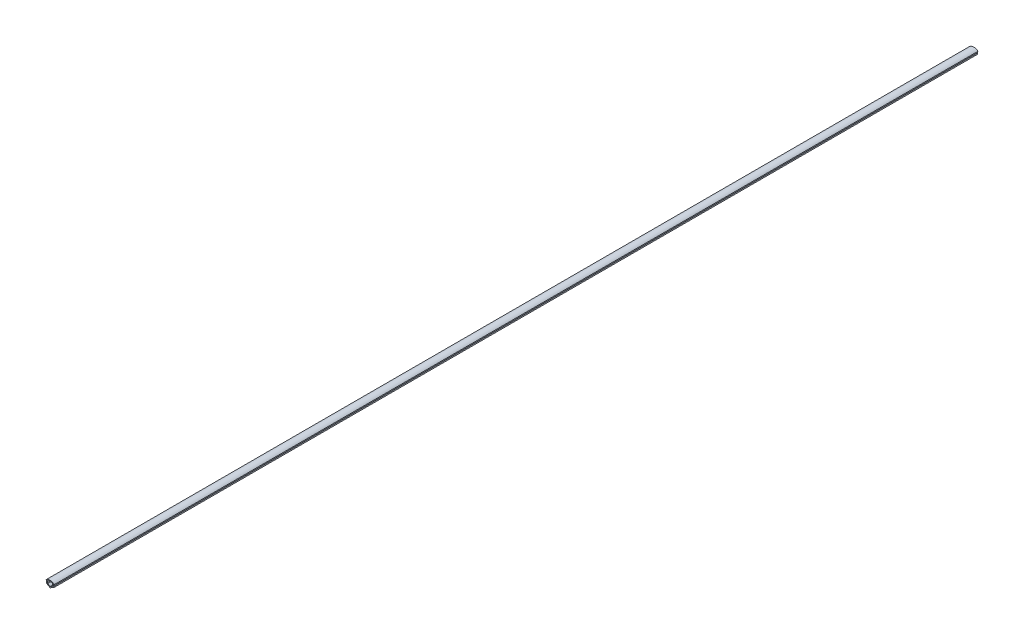
ISO-10303-21;
HEADER;
FILE_DESCRIPTION(('STEP AP214'),'2;1');
FILE_NAME('part.step','',(''),(''),'','','');
FILE_SCHEMA(('AUTOMOTIVE_DESIGN { 1 0 10303 214 1 1 1 1 }'));
ENDSEC;
DATA;
#1=APPLICATION_CONTEXT('core data for automotive mechanical design processes');
#2=APPLICATION_PROTOCOL_DEFINITION('international standard','automotive_design',2000,#1);
#3=PRODUCT_CONTEXT('',#1,'mechanical');
#4=PRODUCT('Part','Part','',(#3));
#5=PRODUCT_RELATED_PRODUCT_CATEGORY('part','',(#4));
#6=PRODUCT_DEFINITION_FORMATION('','',#4);
#7=PRODUCT_DEFINITION_CONTEXT('part definition',#1,'design');
#8=PRODUCT_DEFINITION('design','',#6,#7);
#9=PRODUCT_DEFINITION_SHAPE('','',#8);
#10=(LENGTH_UNIT() NAMED_UNIT(*) SI_UNIT(.MILLI.,.METRE.));
#11=(NAMED_UNIT(*) PLANE_ANGLE_UNIT() SI_UNIT($,.RADIAN.));
#12=(NAMED_UNIT(*) SI_UNIT($,.STERADIAN.) SOLID_ANGLE_UNIT());
#13=UNCERTAINTY_MEASURE_WITH_UNIT(LENGTH_MEASURE(1.E-05),#10,'distance_accuracy_value','');
#14=(GEOMETRIC_REPRESENTATION_CONTEXT(3) GLOBAL_UNCERTAINTY_ASSIGNED_CONTEXT((#13)) GLOBAL_UNIT_ASSIGNED_CONTEXT((#10,
#11,#12)) REPRESENTATION_CONTEXT('',''));
#15=CARTESIAN_POINT('',(0.,0.,0.));
#16=DIRECTION('',(0.,0.,1.));
#17=DIRECTION('',(1.,0.,0.));
#18=AXIS2_PLACEMENT_3D('',#15,#16,#17);
#19=CARTESIAN_POINT('',(0.,0.,1000.));
#20=DIRECTION('',(-0.499999999999998,-0.86602540378444,0.));
#21=DIRECTION('',(0.86602540378444,-0.499999999999998,0.));
#22=AXIS2_PLACEMENT_3D('',#19,#20,#21);
#23=PLANE('',#22);
#24=DIRECTION('',(-0.86602540378444,0.499999999999998,0.));
#25=VECTOR('',#24,1.);
#26=CARTESIAN_POINT('',(0.,0.,0.));
#27=LINE('',#26,#25);
#28=CARTESIAN_POINT('',(0.,0.,0.));
#29=VERTEX_POINT('',#28);
#30=CARTESIAN_POINT('',(-4.25,2.45373864405589,0.));
#31=VERTEX_POINT('',#30);
#32=EDGE_CURVE('E184',#29,#31,#27,.T.);
#33=ORIENTED_EDGE('',*,*,#32,.F.);
#34=DIRECTION('',(0.,0.,-1.));
#35=VECTOR('',#34,1.);
#36=CARTESIAN_POINT('',(0.,0.,1000.));
#37=LINE('',#36,#35);
#38=CARTESIAN_POINT('',(0.,0.,1000.));
#39=VERTEX_POINT('',#38);
#40=EDGE_CURVE('E11',#39,#29,#37,.T.);
#41=ORIENTED_EDGE('',*,*,#40,.F.);
#42=DIRECTION('',(-0.86602540378444,0.499999999999998,0.));
#43=VECTOR('',#42,1.);
#44=CARTESIAN_POINT('',(0.,0.,1000.));
#45=LINE('',#44,#43);
#46=CARTESIAN_POINT('',(-4.25,2.45373864405589,1000.));
#47=VERTEX_POINT('',#46);
#48=EDGE_CURVE('E262',#39,#47,#45,.T.);
#49=ORIENTED_EDGE('',*,*,#48,.T.);
#50=DIRECTION('',(0.,0.,-1.));
#51=VECTOR('',#50,1.);
#52=CARTESIAN_POINT('',(-4.25,2.45373864405589,1000.));
#53=LINE('',#52,#51);
#54=EDGE_CURVE('E54',#47,#31,#53,.T.);
#55=ORIENTED_EDGE('',*,*,#54,.T.);
#56=EDGE_LOOP('',(#33,#41,#49,#55));
#57=FACE_BOUND('',#56,.T.);
#58=ADVANCED_FACE('F35',(#57),#23,.T.);
#59=CARTESIAN_POINT('',(0.,0.,1000.));
#60=DIRECTION('',(-0.499999999999998,0.86602540378444,0.));
#61=DIRECTION('',(-0.86602540378444,-0.499999999999998,0.));
#62=AXIS2_PLACEMENT_3D('',#59,#60,#61);
#63=PLANE('',#62);
#64=DIRECTION('',(0.86602540378444,0.499999999999998,0.));
#65=VECTOR('',#64,1.);
#66=CARTESIAN_POINT('',(0.,0.,0.));
#67=LINE('',#66,#65);
#68=CARTESIAN_POINT('',(4.25,2.45373864405589,0.));
#69=VERTEX_POINT('',#68);
#70=EDGE_CURVE('E186',#29,#69,#67,.T.);
#71=ORIENTED_EDGE('',*,*,#70,.T.);
#72=DIRECTION('',(0.,0.,-1.));
#73=VECTOR('',#72,1.);
#74=CARTESIAN_POINT('',(4.25,2.45373864405589,1000.));
#75=LINE('',#74,#73);
#76=CARTESIAN_POINT('',(4.25,2.45373864405589,1000.));
#77=VERTEX_POINT('',#76);
#78=EDGE_CURVE('E45',#77,#69,#75,.T.);
#79=ORIENTED_EDGE('',*,*,#78,.F.);
#80=DIRECTION('',(0.86602540378444,0.499999999999998,0.));
#81=VECTOR('',#80,1.);
#82=CARTESIAN_POINT('',(0.,0.,1000.));
#83=LINE('',#82,#81);
#84=EDGE_CURVE('E264',#39,#77,#83,.T.);
#85=ORIENTED_EDGE('',*,*,#84,.F.);
#86=ORIENTED_EDGE('',*,*,#40,.T.);
#87=EDGE_LOOP('',(#71,#79,#85,#86));
#88=FACE_BOUND('',#87,.T.);
#89=ADVANCED_FACE('F291',(#88),#63,.F.);
#90=CARTESIAN_POINT('',(4.25,2.45373864405589,1000.));
#91=DIRECTION('',(-0.86602540378444,-0.499999999999998,0.));
#92=DIRECTION('',(0.499999999999998,-0.86602540378444,0.));
#93=AXIS2_PLACEMENT_3D('',#90,#91,#92);
#94=PLANE('',#93);
#95=DIRECTION('',(-0.499999999999998,0.86602540378444,0.));
#96=VECTOR('',#95,1.);
#97=CARTESIAN_POINT('',(4.25,2.45373864405589,0.));
#98=LINE('',#97,#96);
#99=CARTESIAN_POINT('',(3.75,3.31976404784033,0.));
#100=VERTEX_POINT('',#99);
#101=EDGE_CURVE('E189',#69,#100,#98,.T.);
#102=ORIENTED_EDGE('',*,*,#101,.T.);
#103=DIRECTION('',(0.,0.,-1.));
#104=VECTOR('',#103,1.);
#105=CARTESIAN_POINT('',(3.75,3.31976404784033,1000.));
#106=LINE('',#105,#104);
#107=CARTESIAN_POINT('',(3.75,3.31976404784033,1000.));
#108=VERTEX_POINT('',#107);
#109=EDGE_CURVE('E216',#108,#100,#106,.T.);
#110=ORIENTED_EDGE('',*,*,#109,.F.);
#111=DIRECTION('',(-0.499999999999998,0.86602540378444,0.));
#112=VECTOR('',#111,1.);
#113=CARTESIAN_POINT('',(4.25,2.45373864405589,1000.));
#114=LINE('',#113,#112);
#115=EDGE_CURVE('E267',#77,#108,#114,.T.);
#116=ORIENTED_EDGE('',*,*,#115,.F.);
#117=ORIENTED_EDGE('',*,*,#78,.T.);
#118=EDGE_LOOP('',(#102,#110,#116,#117));
#119=FACE_BOUND('',#118,.T.);
#120=ADVANCED_FACE('F296',(#119),#94,.F.);
#121=CARTESIAN_POINT('',(3.75,0.,1000.));
#122=DIRECTION('',(-1.,0.,0.));
#123=DIRECTION('',(0.,0.,1.));
#124=AXIS2_PLACEMENT_3D('',#121,#122,#123);
#125=PLANE('',#124);
#126=DIRECTION('',(0.,1.,0.));
#127=VECTOR('',#126,1.);
#128=CARTESIAN_POINT('',(3.75,0.,0.));
#129=LINE('',#128,#127);
#130=CARTESIAN_POINT('',(3.75,5.33268225192539,0.));
#131=VERTEX_POINT('',#130);
#132=EDGE_CURVE('E192',#100,#131,#129,.T.);
#133=ORIENTED_EDGE('',*,*,#132,.T.);
#134=DIRECTION('',(0.,0.,-1.));
#135=VECTOR('',#134,1.);
#136=CARTESIAN_POINT('',(3.75,5.33268225192539,1000.));
#137=LINE('',#136,#135);
#138=CARTESIAN_POINT('',(3.75,5.33268225192539,1000.));
#139=VERTEX_POINT('',#138);
#140=EDGE_CURVE('E213',#139,#131,#137,.T.);
#141=ORIENTED_EDGE('',*,*,#140,.F.);
#142=DIRECTION('',(0.,1.,0.));
#143=VECTOR('',#142,1.);
#144=CARTESIAN_POINT('',(3.75,0.,1000.));
#145=LINE('',#144,#143);
#146=EDGE_CURVE('E270',#108,#139,#145,.T.);
#147=ORIENTED_EDGE('',*,*,#146,.F.);
#148=ORIENTED_EDGE('',*,*,#109,.T.);
#149=EDGE_LOOP('',(#133,#141,#147,#148));
#150=FACE_BOUND('',#149,.T.);
#151=ADVANCED_FACE('F321',(#150),#125,.F.);
#152=CARTESIAN_POINT('',(0.,5.33268225192539,1000.));
#153=DIRECTION('',(0.,1.,0.));
#154=DIRECTION('',(0.,0.,1.));
#155=AXIS2_PLACEMENT_3D('',#152,#153,#154);
#156=PLANE('',#155);
#157=DIRECTION('',(1.,0.,0.));
#158=VECTOR('',#157,1.);
#159=CARTESIAN_POINT('',(0.,5.33268225192539,0.));
#160=LINE('',#159,#158);
#161=CARTESIAN_POINT('',(4.53458928680426,5.33268225192539,0.));
#162=VERTEX_POINT('',#161);
#163=EDGE_CURVE('E195',#131,#162,#160,.T.);
#164=ORIENTED_EDGE('',*,*,#163,.T.);
#165=DIRECTION('',(0.,0.,-1.));
#166=VECTOR('',#165,1.);
#167=CARTESIAN_POINT('',(4.53458928680426,5.33268225192539,1000.));
#168=LINE('',#167,#166);
#169=CARTESIAN_POINT('',(4.53458928680426,5.33268225192539,1000.));
#170=VERTEX_POINT('',#169);
#171=EDGE_CURVE('E211',#170,#162,#168,.T.);
#172=ORIENTED_EDGE('',*,*,#171,.F.);
#173=DIRECTION('',(1.,0.,0.));
#174=VECTOR('',#173,1.);
#175=CARTESIAN_POINT('',(0.,5.33268225192539,1000.));
#176=LINE('',#175,#174);
#177=EDGE_CURVE('E273',#139,#170,#176,.T.);
#178=ORIENTED_EDGE('',*,*,#177,.F.);
#179=ORIENTED_EDGE('',*,*,#140,.T.);
#180=EDGE_LOOP('',(#164,#172,#178,#179));
#181=FACE_BOUND('',#180,.T.);
#182=ADVANCED_FACE('F318',(#181),#156,.F.);
#183=CARTESIAN_POINT('',(0.,0.,1000.));
#184=DIRECTION('',(0.,0.,-1.));
#185=DIRECTION('',(-1.,0.,0.));
#186=AXIS2_PLACEMENT_3D('',#183,#184,#185);
#187=CYLINDRICAL_SURFACE('',#186,7.);
#188=CARTESIAN_POINT('',(0.,0.,0.));
#189=DIRECTION('',(0.,0.,1.));
#190=DIRECTION('',(1.,0.,0.));
#191=AXIS2_PLACEMENT_3D('',#188,#189,#190);
#192=CIRCLE('',#191,7.);
#193=CARTESIAN_POINT('',(-4.53458928680426,5.33268225192539,0.));
#194=VERTEX_POINT('',#193);
#195=EDGE_CURVE('E198',#194,#162,#192,.F.);
#196=ORIENTED_EDGE('',*,*,#195,.F.);
#197=DIRECTION('',(0.,0.,-1.));
#198=VECTOR('',#197,1.);
#199=CARTESIAN_POINT('',(-4.53458928680426,5.33268225192539,1000.));
#200=LINE('',#199,#198);
#201=CARTESIAN_POINT('',(-4.53458928680426,5.33268225192539,1000.));
#202=VERTEX_POINT('',#201);
#203=EDGE_CURVE('E152',#202,#194,#200,.T.);
#204=ORIENTED_EDGE('',*,*,#203,.F.);
#205=CARTESIAN_POINT('',(0.,0.,1000.));
#206=DIRECTION('',(0.,0.,1.));
#207=DIRECTION('',(1.,0.,0.));
#208=AXIS2_PLACEMENT_3D('',#205,#206,#207);
#209=CIRCLE('',#208,7.);
#210=EDGE_CURVE('E162',#202,#170,#209,.F.);
#211=ORIENTED_EDGE('',*,*,#210,.T.);
#212=ORIENTED_EDGE('',*,*,#171,.T.);
#213=EDGE_LOOP('',(#196,#204,#211,#212));
#214=FACE_BOUND('',#213,.T.);
#215=ADVANCED_FACE('F276',(#214),#187,.T.);
#216=CARTESIAN_POINT('',(0.,5.33268225192539,1000.));
#217=DIRECTION('',(0.,-1.,0.));
#218=DIRECTION('',(0.,0.,-1.));
#219=AXIS2_PLACEMENT_3D('',#216,#217,#218);
#220=PLANE('',#219);
#221=DIRECTION('',(-1.,0.,0.));
#222=VECTOR('',#221,1.);
#223=CARTESIAN_POINT('',(0.,5.33268225192539,0.));
#224=LINE('',#223,#222);
#225=CARTESIAN_POINT('',(-3.75,5.33268225192539,0.));
#226=VERTEX_POINT('',#225);
#227=EDGE_CURVE('E148',#226,#194,#224,.T.);
#228=ORIENTED_EDGE('',*,*,#227,.F.);
#229=DIRECTION('',(0.,0.,-1.));
#230=VECTOR('',#229,1.);
#231=CARTESIAN_POINT('',(-3.75,5.33268225192539,1000.));
#232=LINE('',#231,#230);
#233=CARTESIAN_POINT('',(-3.75,5.33268225192539,1000.));
#234=VERTEX_POINT('',#233);
#235=EDGE_CURVE('E143',#234,#226,#232,.T.);
#236=ORIENTED_EDGE('',*,*,#235,.F.);
#237=DIRECTION('',(-1.,0.,0.));
#238=VECTOR('',#237,1.);
#239=CARTESIAN_POINT('',(0.,5.33268225192539,1000.));
#240=LINE('',#239,#238);
#241=EDGE_CURVE('E146',#234,#202,#240,.T.);
#242=ORIENTED_EDGE('',*,*,#241,.T.);
#243=ORIENTED_EDGE('',*,*,#203,.T.);
#244=EDGE_LOOP('',(#228,#236,#242,#243));
#245=FACE_BOUND('',#244,.T.);
#246=ADVANCED_FACE('F145',(#245),#220,.T.);
#247=CARTESIAN_POINT('',(-3.75,0.,1000.));
#248=DIRECTION('',(-1.,0.,0.));
#249=DIRECTION('',(0.,0.,1.));
#250=AXIS2_PLACEMENT_3D('',#247,#248,#249);
#251=PLANE('',#250);
#252=DIRECTION('',(0.,1.,0.));
#253=VECTOR('',#252,1.);
#254=CARTESIAN_POINT('',(-3.75,0.,0.));
#255=LINE('',#254,#253);
#256=CARTESIAN_POINT('',(-3.75,3.31976404784033,0.));
#257=VERTEX_POINT('',#256);
#258=EDGE_CURVE('E202',#257,#226,#255,.T.);
#259=ORIENTED_EDGE('',*,*,#258,.F.);
#260=DIRECTION('',(0.,0.,-1.));
#261=VECTOR('',#260,1.);
#262=CARTESIAN_POINT('',(-3.75,3.31976404784033,1000.));
#263=LINE('',#262,#261);
#264=CARTESIAN_POINT('',(-3.75,3.31976404784033,1000.));
#265=VERTEX_POINT('',#264);
#266=EDGE_CURVE('E97',#265,#257,#263,.T.);
#267=ORIENTED_EDGE('',*,*,#266,.F.);
#268=DIRECTION('',(0.,1.,0.));
#269=VECTOR('',#268,1.);
#270=CARTESIAN_POINT('',(-3.75,0.,1000.));
#271=LINE('',#270,#269);
#272=EDGE_CURVE('E160',#265,#234,#271,.T.);
#273=ORIENTED_EDGE('',*,*,#272,.T.);
#274=ORIENTED_EDGE('',*,*,#235,.T.);
#275=EDGE_LOOP('',(#259,#267,#273,#274));
#276=FACE_BOUND('',#275,.T.);
#277=ADVANCED_FACE('F164',(#276),#251,.T.);
#278=CARTESIAN_POINT('',(-0.499999999999998,0.86602540378444,1000.));
#279=DIRECTION('',(-0.499999999999998,0.86602540378444,0.));
#280=DIRECTION('',(-0.86602540378444,-0.499999999999998,0.));
#281=AXIS2_PLACEMENT_3D('',#278,#279,#280);
#282=PLANE('',#281);
#283=DIRECTION('',(0.86602540378444,0.499999999999998,0.));
#284=VECTOR('',#283,1.);
#285=CARTESIAN_POINT('',(-0.499999999999998,0.86602540378444,0.));
#286=LINE('',#285,#284);
#287=CARTESIAN_POINT('',(0.,1.15470053837925,0.));
#288=VERTEX_POINT('',#287);
#289=CARTESIAN_POINT('',(2.75,2.74241377865071,0.));
#290=VERTEX_POINT('',#289);
#291=EDGE_CURVE('E171',#288,#290,#286,.T.);
#292=ORIENTED_EDGE('',*,*,#291,.F.);
#293=DIRECTION('',(0.,0.,-1.));
#294=VECTOR('',#293,1.);
#295=CARTESIAN_POINT('',(0.,1.15470053837925,1000.));
#296=LINE('',#295,#294);
#297=CARTESIAN_POINT('',(0.,1.15470053837925,1000.));
#298=VERTEX_POINT('',#297);
#299=EDGE_CURVE('E39',#298,#288,#296,.T.);
#300=ORIENTED_EDGE('',*,*,#299,.F.);
#301=DIRECTION('',(0.86602540378444,0.499999999999998,0.));
#302=VECTOR('',#301,1.);
#303=CARTESIAN_POINT('',(-0.499999999999998,0.86602540378444,1000.));
#304=LINE('',#303,#302);
#305=CARTESIAN_POINT('',(2.75,2.74241377865071,1000.));
#306=VERTEX_POINT('',#305);
#307=EDGE_CURVE('E207',#298,#306,#304,.T.);
#308=ORIENTED_EDGE('',*,*,#307,.T.);
#309=DIRECTION('',(0.,0.,-1.));
#310=VECTOR('',#309,1.);
#311=CARTESIAN_POINT('',(2.75,2.74241377865071,1000.));
#312=LINE('',#311,#310);
#313=EDGE_CURVE('E167',#306,#290,#312,.T.);
#314=ORIENTED_EDGE('',*,*,#313,.T.);
#315=EDGE_LOOP('',(#292,#300,#308,#314));
#316=FACE_BOUND('',#315,.T.);
#317=ADVANCED_FACE('F37',(#316),#282,.T.);
#318=CARTESIAN_POINT('',(0.499999999999998,0.86602540378444,1000.));
#319=DIRECTION('',(-0.499999999999998,-0.86602540378444,0.));
#320=DIRECTION('',(0.86602540378444,-0.499999999999998,0.));
#321=AXIS2_PLACEMENT_3D('',#318,#319,#320);
#322=PLANE('',#321);
#323=DIRECTION('',(-0.86602540378444,0.499999999999998,0.));
#324=VECTOR('',#323,1.);
#325=CARTESIAN_POINT('',(0.499999999999998,0.86602540378444,0.));
#326=LINE('',#325,#324);
#327=CARTESIAN_POINT('',(-2.75,2.74241377865071,0.));
#328=VERTEX_POINT('',#327);
#329=EDGE_CURVE('E174',#288,#328,#326,.T.);
#330=ORIENTED_EDGE('',*,*,#329,.T.);
#331=DIRECTION('',(0.,0.,-1.));
#332=VECTOR('',#331,1.);
#333=CARTESIAN_POINT('',(-2.75,2.74241377865071,1000.));
#334=LINE('',#333,#332);
#335=CARTESIAN_POINT('',(-2.75,2.74241377865071,1000.));
#336=VERTEX_POINT('',#335);
#337=EDGE_CURVE('E226',#336,#328,#334,.T.);
#338=ORIENTED_EDGE('',*,*,#337,.F.);
#339=DIRECTION('',(-0.86602540378444,0.499999999999998,0.));
#340=VECTOR('',#339,1.);
#341=CARTESIAN_POINT('',(0.499999999999998,0.86602540378444,1000.));
#342=LINE('',#341,#340);
#343=EDGE_CURVE('E235',#298,#336,#342,.T.);
#344=ORIENTED_EDGE('',*,*,#343,.F.);
#345=ORIENTED_EDGE('',*,*,#299,.T.);
#346=EDGE_LOOP('',(#330,#338,#344,#345));
#347=FACE_BOUND('',#346,.T.);
#348=ADVANCED_FACE('F234',(#347),#322,.F.);
#349=CARTESIAN_POINT('',(-2.75,0.,1000.));
#350=DIRECTION('',(-1.,0.,0.));
#351=DIRECTION('',(0.,0.,1.));
#352=AXIS2_PLACEMENT_3D('',#349,#350,#351);
#353=PLANE('',#352);
#354=DIRECTION('',(0.,1.,0.));
#355=VECTOR('',#354,1.);
#356=CARTESIAN_POINT('',(-2.75,0.,0.));
#357=LINE('',#356,#355);
#358=CARTESIAN_POINT('',(-2.75,5.33268225192539,0.));
#359=VERTEX_POINT('',#358);
#360=EDGE_CURVE('E176',#328,#359,#357,.T.);
#361=ORIENTED_EDGE('',*,*,#360,.T.);
#362=DIRECTION('',(0.,0.,-1.));
#363=VECTOR('',#362,1.);
#364=CARTESIAN_POINT('',(-2.75,5.33268225192539,1000.));
#365=LINE('',#364,#363);
#366=CARTESIAN_POINT('',(-2.75,5.33268225192539,1000.));
#367=VERTEX_POINT('',#366);
#368=EDGE_CURVE('E224',#367,#359,#365,.T.);
#369=ORIENTED_EDGE('',*,*,#368,.F.);
#370=DIRECTION('',(0.,1.,0.));
#371=VECTOR('',#370,1.);
#372=CARTESIAN_POINT('',(-2.75,0.,1000.));
#373=LINE('',#372,#371);
#374=EDGE_CURVE('E254',#336,#367,#373,.T.);
#375=ORIENTED_EDGE('',*,*,#374,.F.);
#376=ORIENTED_EDGE('',*,*,#337,.T.);
#377=EDGE_LOOP('',(#361,#369,#375,#376));
#378=FACE_BOUND('',#377,.T.);
#379=ADVANCED_FACE('F253',(#378),#353,.F.);
#380=CARTESIAN_POINT('',(0.,0.,1000.));
#381=DIRECTION('',(0.,0.,-1.));
#382=DIRECTION('',(-1.,0.,0.));
#383=AXIS2_PLACEMENT_3D('',#380,#381,#382);
#384=CYLINDRICAL_SURFACE('',#383,6.);
#385=CARTESIAN_POINT('',(0.,0.,0.));
#386=DIRECTION('',(0.,0.,1.));
#387=DIRECTION('',(1.,0.,0.));
#388=AXIS2_PLACEMENT_3D('',#385,#386,#387);
#389=CIRCLE('',#388,6.);
#390=CARTESIAN_POINT('',(2.75,5.33268225192539,0.));
#391=VERTEX_POINT('',#390);
#392=EDGE_CURVE('E178',#359,#391,#389,.F.);
#393=ORIENTED_EDGE('',*,*,#392,.T.);
#394=DIRECTION('',(0.,0.,-1.));
#395=VECTOR('',#394,1.);
#396=CARTESIAN_POINT('',(2.75,5.33268225192539,1000.));
#397=LINE('',#396,#395);
#398=CARTESIAN_POINT('',(2.75,5.33268225192539,1000.));
#399=VERTEX_POINT('',#398);
#400=EDGE_CURVE('E222',#399,#391,#397,.T.);
#401=ORIENTED_EDGE('',*,*,#400,.F.);
#402=CARTESIAN_POINT('',(0.,0.,1000.));
#403=DIRECTION('',(0.,0.,1.));
#404=DIRECTION('',(1.,0.,0.));
#405=AXIS2_PLACEMENT_3D('',#402,#403,#404);
#406=CIRCLE('',#405,6.);
#407=EDGE_CURVE('E252',#367,#399,#406,.F.);
#408=ORIENTED_EDGE('',*,*,#407,.F.);
#409=ORIENTED_EDGE('',*,*,#368,.T.);
#410=EDGE_LOOP('',(#393,#401,#408,#409));
#411=FACE_BOUND('',#410,.T.);
#412=ADVANCED_FACE('F249',(#411),#384,.F.);
#413=CARTESIAN_POINT('',(2.75,0.,1000.));
#414=DIRECTION('',(-1.,0.,0.));
#415=DIRECTION('',(0.,0.,1.));
#416=AXIS2_PLACEMENT_3D('',#413,#414,#415);
#417=PLANE('',#416);
#418=DIRECTION('',(0.,1.,0.));
#419=VECTOR('',#418,1.);
#420=CARTESIAN_POINT('',(2.75,0.,0.));
#421=LINE('',#420,#419);
#422=EDGE_CURVE('E181',#290,#391,#421,.T.);
#423=ORIENTED_EDGE('',*,*,#422,.F.);
#424=ORIENTED_EDGE('',*,*,#313,.F.);
#425=DIRECTION('',(0.,1.,0.));
#426=VECTOR('',#425,1.);
#427=CARTESIAN_POINT('',(2.75,0.,1000.));
#428=LINE('',#427,#426);
#429=EDGE_CURVE('E246',#306,#399,#428,.T.);
#430=ORIENTED_EDGE('',*,*,#429,.T.);
#431=ORIENTED_EDGE('',*,*,#400,.T.);
#432=EDGE_LOOP('',(#423,#424,#430,#431));
#433=FACE_BOUND('',#432,.T.);
#434=ADVANCED_FACE('F245',(#433),#417,.T.);
#435=CARTESIAN_POINT('',(-4.25,2.4537386440559,1000.));
#436=DIRECTION('',(-0.866025403784439,0.499999999999999,0.));
#437=DIRECTION('',(-0.499999999999999,-0.86602540378444,0.));
#438=AXIS2_PLACEMENT_3D('',#435,#436,#437);
#439=PLANE('',#438);
#440=DIRECTION('',(0.499999999999999,0.86602540378444,0.));
#441=VECTOR('',#440,1.);
#442=CARTESIAN_POINT('',(-4.25,2.4537386440559,0.));
#443=LINE('',#442,#441);
#444=EDGE_CURVE('E204',#31,#257,#443,.T.);
#445=ORIENTED_EDGE('',*,*,#444,.F.);
#446=ORIENTED_EDGE('',*,*,#54,.F.);
#447=DIRECTION('',(0.499999999999999,0.86602540378444,0.));
#448=VECTOR('',#447,1.);
#449=CARTESIAN_POINT('',(-4.25,2.4537386440559,1000.));
#450=LINE('',#449,#448);
#451=EDGE_CURVE('E165',#47,#265,#450,.T.);
#452=ORIENTED_EDGE('',*,*,#451,.T.);
#453=ORIENTED_EDGE('',*,*,#266,.T.);
#454=EDGE_LOOP('',(#445,#446,#452,#453));
#455=FACE_BOUND('',#454,.T.);
#456=ADVANCED_FACE('F279',(#455),#439,.T.);
#457=CARTESIAN_POINT('',(0.,0.,1000.));
#458=DIRECTION('',(0.,0.,1.));
#459=DIRECTION('',(1.,0.,0.));
#460=AXIS2_PLACEMENT_3D('',#457,#458,#459);
#461=PLANE('',#460);
#462=ORIENTED_EDGE('',*,*,#307,.F.);
#463=ORIENTED_EDGE('',*,*,#343,.T.);
#464=ORIENTED_EDGE('',*,*,#374,.T.);
#465=ORIENTED_EDGE('',*,*,#407,.T.);
#466=ORIENTED_EDGE('',*,*,#429,.F.);
#467=EDGE_LOOP('',(#462,#463,#464,#465,#466));
#468=FACE_BOUND('',#467,.T.);
#469=ORIENTED_EDGE('',*,*,#48,.F.);
#470=ORIENTED_EDGE('',*,*,#84,.T.);
#471=ORIENTED_EDGE('',*,*,#115,.T.);
#472=ORIENTED_EDGE('',*,*,#146,.T.);
#473=ORIENTED_EDGE('',*,*,#177,.T.);
#474=ORIENTED_EDGE('',*,*,#210,.F.);
#475=ORIENTED_EDGE('',*,*,#241,.F.);
#476=ORIENTED_EDGE('',*,*,#272,.F.);
#477=ORIENTED_EDGE('',*,*,#451,.F.);
#478=EDGE_LOOP('',(#469,#470,#471,#472,#473,#474,#475,#476,#477));
#479=FACE_BOUND('',#478,.T.);
#480=ADVANCED_FACE('F158',(#468,#479),#461,.T.);
#481=CARTESIAN_POINT('',(0.,0.,0.));
#482=DIRECTION('',(0.,0.,1.));
#483=DIRECTION('',(1.,0.,0.));
#484=AXIS2_PLACEMENT_3D('',#481,#482,#483);
#485=PLANE('',#484);
#486=ORIENTED_EDGE('',*,*,#291,.T.);
#487=ORIENTED_EDGE('',*,*,#422,.T.);
#488=ORIENTED_EDGE('',*,*,#392,.F.);
#489=ORIENTED_EDGE('',*,*,#360,.F.);
#490=ORIENTED_EDGE('',*,*,#329,.F.);
#491=EDGE_LOOP('',(#486,#487,#488,#489,#490));
#492=FACE_BOUND('',#491,.T.);
#493=ORIENTED_EDGE('',*,*,#32,.T.);
#494=ORIENTED_EDGE('',*,*,#444,.T.);
#495=ORIENTED_EDGE('',*,*,#258,.T.);
#496=ORIENTED_EDGE('',*,*,#227,.T.);
#497=ORIENTED_EDGE('',*,*,#195,.T.);
#498=ORIENTED_EDGE('',*,*,#163,.F.);
#499=ORIENTED_EDGE('',*,*,#132,.F.);
#500=ORIENTED_EDGE('',*,*,#101,.F.);
#501=ORIENTED_EDGE('',*,*,#70,.F.);
#502=EDGE_LOOP('',(#493,#494,#495,#496,#497,#498,#499,#500,#501));
#503=FACE_BOUND('',#502,.T.);
#504=ADVANCED_FACE('F238',(#492,#503),#485,.F.);
#505=CLOSED_SHELL('',(#58,#89,#120,#151,#182,#215,#246,#277,#317,#348,#379,#412,#434,#456,#480,#504));
#506=MANIFOLD_SOLID_BREP('B2',#505);
#507=ADVANCED_BREP_SHAPE_REPRESENTATION('',(#18,#506),#14);
#508=SHAPE_DEFINITION_REPRESENTATION(#9,#507);
ENDSEC;
END-ISO-10303-21;
